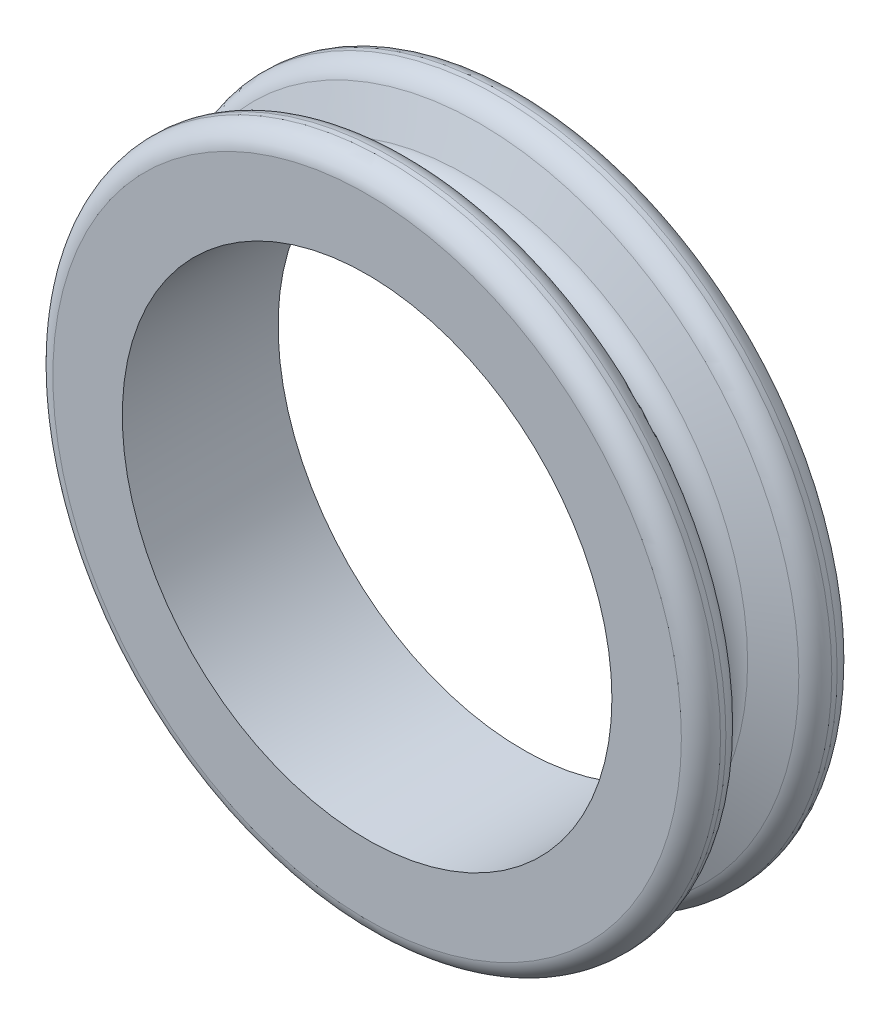
ISO-10303-21;
HEADER;
FILE_DESCRIPTION(('STEP AP214'),'2;1');
FILE_NAME('part.step','',(''),(''),'','','');
FILE_SCHEMA(('AUTOMOTIVE_DESIGN { 1 0 10303 214 1 1 1 1 }'));
ENDSEC;
DATA;
#1=APPLICATION_CONTEXT('core data for automotive mechanical design processes');
#2=APPLICATION_PROTOCOL_DEFINITION('international standard','automotive_design',2000,#1);
#3=PRODUCT_CONTEXT('',#1,'mechanical');
#4=PRODUCT('Part','Part','',(#3));
#5=PRODUCT_RELATED_PRODUCT_CATEGORY('part','',(#4));
#6=PRODUCT_DEFINITION_FORMATION('','',#4);
#7=PRODUCT_DEFINITION_CONTEXT('part definition',#1,'design');
#8=PRODUCT_DEFINITION('design','',#6,#7);
#9=PRODUCT_DEFINITION_SHAPE('','',#8);
#10=(LENGTH_UNIT() NAMED_UNIT(*) SI_UNIT(.MILLI.,.METRE.));
#11=(NAMED_UNIT(*) PLANE_ANGLE_UNIT() SI_UNIT($,.RADIAN.));
#12=(NAMED_UNIT(*) SI_UNIT($,.STERADIAN.) SOLID_ANGLE_UNIT());
#13=UNCERTAINTY_MEASURE_WITH_UNIT(LENGTH_MEASURE(1.E-05),#10,'distance_accuracy_value','');
#14=(GEOMETRIC_REPRESENTATION_CONTEXT(3) GLOBAL_UNCERTAINTY_ASSIGNED_CONTEXT((#13)) GLOBAL_UNIT_ASSIGNED_CONTEXT((#10,
#11,#12)) REPRESENTATION_CONTEXT('',''));
#15=CARTESIAN_POINT('',(0.,0.,0.));
#16=DIRECTION('',(0.,0.,1.));
#17=DIRECTION('',(1.,0.,0.));
#18=AXIS2_PLACEMENT_3D('',#15,#16,#17);
#19=CARTESIAN_POINT('',(0.,0.,-3.5));
#20=DIRECTION('',(0.,0.,1.));
#21=DIRECTION('',(1.,0.,0.));
#22=AXIS2_PLACEMENT_3D('',#19,#20,#21);
#23=PLANE('',#22);
#24=CARTESIAN_POINT('',(0.,0.,-3.5));
#25=DIRECTION('',(0.,0.,1.));
#26=DIRECTION('',(1.,0.,0.));
#27=AXIS2_PLACEMENT_3D('',#24,#25,#26);
#28=CIRCLE('',#27,11.);
#29=CARTESIAN_POINT('',(11.,0.,-3.5));
#30=VERTEX_POINT('',#29);
#31=EDGE_CURVE('E11',#30,#30,#28,.T.);
#32=ORIENTED_EDGE('',*,*,#31,.T.);
#33=EDGE_LOOP('',(#32));
#34=FACE_BOUND('',#33,.T.);
#35=CARTESIAN_POINT('',(0.,0.,-3.5));
#36=DIRECTION('',(0.,0.,1.));
#37=DIRECTION('',(1.,0.,0.));
#38=AXIS2_PLACEMENT_3D('',#35,#36,#37);
#39=CIRCLE('',#38,14.1203113531334);
#40=CARTESIAN_POINT('',(14.1203113531334,0.,-3.5));
#41=VERTEX_POINT('',#40);
#42=EDGE_CURVE('E42',#41,#41,#39,.T.);
#43=ORIENTED_EDGE('',*,*,#42,.F.);
#44=EDGE_LOOP('',(#43));
#45=FACE_BOUND('',#44,.T.);
#46=ADVANCED_FACE('F38',(#34,#45),#23,.F.);
#47=CARTESIAN_POINT('',(0.,0.,-3.5));
#48=DIRECTION('',(0.,0.,1.));
#49=DIRECTION('',(1.,0.,0.));
#50=AXIS2_PLACEMENT_3D('',#47,#48,#49);
#51=CYLINDRICAL_SURFACE('',#50,11.);
#52=ORIENTED_EDGE('',*,*,#31,.F.);
#53=EDGE_LOOP('',(#52));
#54=FACE_BOUND('',#53,.T.);
#55=CARTESIAN_POINT('',(0.,0.,3.5));
#56=DIRECTION('',(0.,0.,1.));
#57=DIRECTION('',(1.,0.,0.));
#58=AXIS2_PLACEMENT_3D('',#55,#56,#57);
#59=CIRCLE('',#58,11.);
#60=CARTESIAN_POINT('',(11.,0.,3.5));
#61=VERTEX_POINT('',#60);
#62=EDGE_CURVE('E46',#61,#61,#59,.T.);
#63=ORIENTED_EDGE('',*,*,#62,.T.);
#64=EDGE_LOOP('',(#63));
#65=FACE_BOUND('',#64,.T.);
#66=ADVANCED_FACE('F125',(#54,#65),#51,.F.);
#67=CARTESIAN_POINT('',(0.,0.,3.5));
#68=DIRECTION('',(0.,0.,1.));
#69=DIRECTION('',(1.,0.,0.));
#70=AXIS2_PLACEMENT_3D('',#67,#68,#69);
#71=PLANE('',#70);
#72=CARTESIAN_POINT('',(0.,0.,3.5));
#73=DIRECTION('',(0.,0.,1.));
#74=DIRECTION('',(1.,0.,0.));
#75=AXIS2_PLACEMENT_3D('',#72,#73,#74);
#76=CIRCLE('',#75,14.1203113531334);
#77=CARTESIAN_POINT('',(14.1203113531334,0.,3.5));
#78=VERTEX_POINT('',#77);
#79=EDGE_CURVE('E59',#78,#78,#76,.T.);
#80=ORIENTED_EDGE('',*,*,#79,.T.);
#81=EDGE_LOOP('',(#80));
#82=FACE_BOUND('',#81,.T.);
#83=ORIENTED_EDGE('',*,*,#62,.F.);
#84=EDGE_LOOP('',(#83));
#85=FACE_BOUND('',#84,.T.);
#86=ADVANCED_FACE('F80',(#82,#85),#71,.T.);
#87=CARTESIAN_POINT('',(0.,0.,2.5));
#88=DIRECTION('',(0.,0.,1.));
#89=DIRECTION('',(1.,0.,0.));
#90=AXIS2_PLACEMENT_3D('',#87,#88,#89);
#91=TOROIDAL_SURFACE('',#90,14.,1.00721140863911);
#92=ORIENTED_EDGE('',*,*,#79,.F.);
#93=EDGE_LOOP('',(#92));
#94=FACE_BOUND('',#93,.T.);
#95=CARTESIAN_POINT('',(0.,0.,2.62031135313338));
#96=DIRECTION('',(0.,0.,1.));
#97=DIRECTION('',(1.,0.,0.));
#98=AXIS2_PLACEMENT_3D('',#95,#96,#97);
#99=CIRCLE('',#98,15.);
#100=CARTESIAN_POINT('',(15.,0.,2.62031135313338));
#101=VERTEX_POINT('',#100);
#102=EDGE_CURVE('E74',#101,#101,#99,.T.);
#103=ORIENTED_EDGE('',*,*,#102,.T.);
#104=EDGE_LOOP('',(#103));
#105=FACE_BOUND('',#104,.T.);
#106=ADVANCED_FACE('F83',(#94,#105),#91,.T.);
#107=CARTESIAN_POINT('',(0.,0.,-2.5));
#108=DIRECTION('',(0.,0.,1.));
#109=DIRECTION('',(1.,0.,0.));
#110=AXIS2_PLACEMENT_3D('',#107,#108,#109);
#111=TOROIDAL_SURFACE('',#110,14.,1.00721140863911);
#112=CARTESIAN_POINT('',(0.,0.,-2.62031135313338));
#113=DIRECTION('',(0.,0.,1.));
#114=DIRECTION('',(1.,0.,0.));
#115=AXIS2_PLACEMENT_3D('',#112,#113,#114);
#116=CIRCLE('',#115,15.);
#117=CARTESIAN_POINT('',(15.,0.,-2.62031135313338));
#118=VERTEX_POINT('',#117);
#119=EDGE_CURVE('E52',#118,#118,#116,.T.);
#120=ORIENTED_EDGE('',*,*,#119,.F.);
#121=EDGE_LOOP('',(#120));
#122=FACE_BOUND('',#121,.T.);
#123=ORIENTED_EDGE('',*,*,#42,.T.);
#124=EDGE_LOOP('',(#123));
#125=FACE_BOUND('',#124,.T.);
#126=ADVANCED_FACE('F86',(#122,#125),#111,.T.);
#127=CARTESIAN_POINT('',(0.,0.,-3.5));
#128=DIRECTION('',(0.,0.,1.));
#129=DIRECTION('',(1.,0.,0.));
#130=AXIS2_PLACEMENT_3D('',#127,#128,#129);
#131=CYLINDRICAL_SURFACE('',#130,15.);
#132=ORIENTED_EDGE('',*,*,#119,.T.);
#133=EDGE_LOOP('',(#132));
#134=FACE_BOUND('',#133,.T.);
#135=CARTESIAN_POINT('',(0.,0.,-2.37968864686662));
#136=DIRECTION('',(0.,0.,1.));
#137=DIRECTION('',(1.,0.,0.));
#138=AXIS2_PLACEMENT_3D('',#135,#136,#137);
#139=CIRCLE('',#138,15.);
#140=CARTESIAN_POINT('',(15.,0.,-2.37968864686662));
#141=VERTEX_POINT('',#140);
#142=EDGE_CURVE('E60',#141,#141,#139,.T.);
#143=ORIENTED_EDGE('',*,*,#142,.F.);
#144=EDGE_LOOP('',(#143));
#145=FACE_BOUND('',#144,.T.);
#146=ADVANCED_FACE('F40',(#134,#145),#131,.T.);
#147=ORIENTED_EDGE('',*,*,#102,.F.);
#148=EDGE_LOOP('',(#147));
#149=FACE_BOUND('',#148,.T.);
#150=CARTESIAN_POINT('',(0.,0.,2.37968864686662));
#151=DIRECTION('',(0.,0.,1.));
#152=DIRECTION('',(1.,0.,0.));
#153=AXIS2_PLACEMENT_3D('',#150,#151,#152);
#154=CIRCLE('',#153,15.);
#155=CARTESIAN_POINT('',(15.,0.,2.37968864686662));
#156=VERTEX_POINT('',#155);
#157=EDGE_CURVE('E63',#156,#156,#154,.T.);
#158=ORIENTED_EDGE('',*,*,#157,.T.);
#159=EDGE_LOOP('',(#158));
#160=FACE_BOUND('',#159,.T.);
#161=ADVANCED_FACE('F90',(#149,#160),#131,.T.);
#162=CARTESIAN_POINT('',(0.,0.,-0.939692620785909));
#163=DIRECTION('',(0.,0.,-1.));
#164=DIRECTION('',(-1.,0.,0.));
#165=AXIS2_PLACEMENT_3D('',#162,#163,#164);
#166=CONICAL_SURFACE('',#165,12.6579798566743,1.22173047639604);
#167=CARTESIAN_POINT('',(0.,0.,-1.55353087173044));
#168=DIRECTION('',(0.,0.,1.));
#169=DIRECTION('',(1.,0.,0.));
#170=AXIS2_PLACEMENT_3D('',#167,#168,#169);
#171=CIRCLE('',#170,14.344486590342);
#172=CARTESIAN_POINT('',(14.344486590342,0.,-1.55353087173044));
#173=VERTEX_POINT('',#172);
#174=EDGE_CURVE('E56',#173,#173,#171,.T.);
#175=ORIENTED_EDGE('',*,*,#174,.T.);
#176=EDGE_LOOP('',(#175));
#177=FACE_BOUND('',#176,.T.);
#178=CARTESIAN_POINT('',(0.,0.,-0.939692620785909));
#179=DIRECTION('',(0.,0.,1.));
#180=DIRECTION('',(1.,0.,0.));
#181=AXIS2_PLACEMENT_3D('',#178,#179,#180);
#182=CIRCLE('',#181,12.6579798566743);
#183=CARTESIAN_POINT('',(12.6579798566743,0.,-0.939692620785909));
#184=VERTEX_POINT('',#183);
#185=EDGE_CURVE('E55',#184,#184,#182,.T.);
#186=ORIENTED_EDGE('',*,*,#185,.F.);
#187=EDGE_LOOP('',(#186));
#188=FACE_BOUND('',#187,.T.);
#189=ADVANCED_FACE('F93',(#177,#188),#166,.T.);
#190=CARTESIAN_POINT('',(0.,0.,-2.5));
#191=DIRECTION('',(0.,0.,1.));
#192=DIRECTION('',(1.,0.,0.));
#193=AXIS2_PLACEMENT_3D('',#190,#191,#192);
#194=TOROIDAL_SURFACE('',#193,14.,1.00721140863911);
#195=ORIENTED_EDGE('',*,*,#142,.T.);
#196=EDGE_LOOP('',(#195));
#197=FACE_BOUND('',#196,.T.);
#198=ORIENTED_EDGE('',*,*,#174,.F.);
#199=EDGE_LOOP('',(#198));
#200=FACE_BOUND('',#199,.T.);
#201=ADVANCED_FACE('F100',(#197,#200),#194,.T.);
#202=CARTESIAN_POINT('',(0.,0.,2.5));
#203=DIRECTION('',(0.,0.,1.));
#204=DIRECTION('',(1.,0.,0.));
#205=AXIS2_PLACEMENT_3D('',#202,#203,#204);
#206=TOROIDAL_SURFACE('',#205,14.,1.00721140863911);
#207=ORIENTED_EDGE('',*,*,#157,.F.);
#208=EDGE_LOOP('',(#207));
#209=FACE_BOUND('',#208,.T.);
#210=CARTESIAN_POINT('',(0.,0.,1.55353087173044));
#211=DIRECTION('',(0.,0.,1.));
#212=DIRECTION('',(1.,0.,0.));
#213=AXIS2_PLACEMENT_3D('',#210,#211,#212);
#214=CIRCLE('',#213,14.344486590342);
#215=CARTESIAN_POINT('',(14.344486590342,0.,1.55353087173044));
#216=VERTEX_POINT('',#215);
#217=EDGE_CURVE('E66',#216,#216,#214,.T.);
#218=ORIENTED_EDGE('',*,*,#217,.T.);
#219=EDGE_LOOP('',(#218));
#220=FACE_BOUND('',#219,.T.);
#221=ADVANCED_FACE('F96',(#209,#220),#206,.T.);
#222=CARTESIAN_POINT('',(0.,0.,0.939692620785909));
#223=DIRECTION('',(0.,0.,1.));
#224=DIRECTION('',(1.,0.,0.));
#225=AXIS2_PLACEMENT_3D('',#222,#223,#224);
#226=CONICAL_SURFACE('',#225,12.6579798566743,1.22173047639604);
#227=ORIENTED_EDGE('',*,*,#217,.F.);
#228=EDGE_LOOP('',(#227));
#229=FACE_BOUND('',#228,.T.);
#230=CARTESIAN_POINT('',(0.,0.,0.939692620785909));
#231=DIRECTION('',(0.,0.,1.));
#232=DIRECTION('',(1.,0.,0.));
#233=AXIS2_PLACEMENT_3D('',#230,#231,#232);
#234=CIRCLE('',#233,12.6579798566743);
#235=CARTESIAN_POINT('',(12.6579798566743,0.,0.939692620785909));
#236=VERTEX_POINT('',#235);
#237=EDGE_CURVE('E69',#236,#236,#234,.T.);
#238=ORIENTED_EDGE('',*,*,#237,.T.);
#239=EDGE_LOOP('',(#238));
#240=FACE_BOUND('',#239,.T.);
#241=ADVANCED_FACE('F99',(#229,#240),#226,.T.);
#242=CARTESIAN_POINT('',(0.,0.,0.));
#243=DIRECTION('',(0.,0.,1.));
#244=DIRECTION('',(1.,0.,0.));
#245=AXIS2_PLACEMENT_3D('',#242,#243,#244);
#246=TOROIDAL_SURFACE('',#245,13.,0.999999999999999);
#247=ORIENTED_EDGE('',*,*,#237,.F.);
#248=EDGE_LOOP('',(#247));
#249=FACE_BOUND('',#248,.T.);
#250=ORIENTED_EDGE('',*,*,#185,.T.);
#251=EDGE_LOOP('',(#250));
#252=FACE_BOUND('',#251,.T.);
#253=ADVANCED_FACE('F106',(#249,#252),#246,.F.);
#254=CLOSED_SHELL('',(#46,#66,#86,#106,#126,#146,#161,#189,#201,#221,#241,#253));
#255=MANIFOLD_SOLID_BREP('B2',#254);
#256=ADVANCED_BREP_SHAPE_REPRESENTATION('',(#18,#255),#14);
#257=SHAPE_DEFINITION_REPRESENTATION(#9,#256);
ENDSEC;
END-ISO-10303-21;
